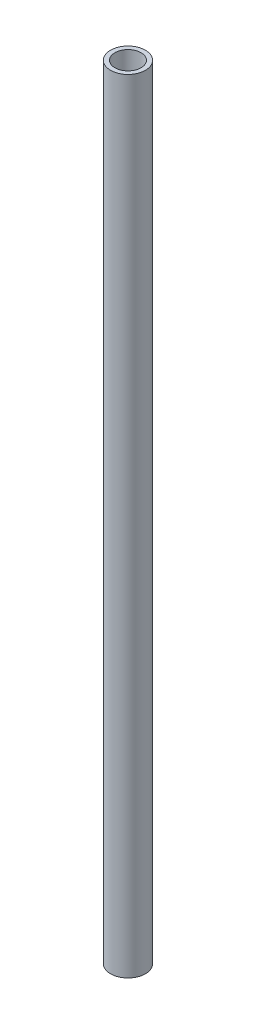
ISO-10303-21;
HEADER;
FILE_DESCRIPTION(('STEP AP214'),'2;1');
FILE_NAME('part.step','',(''),(''),'','','');
FILE_SCHEMA(('AUTOMOTIVE_DESIGN { 1 0 10303 214 1 1 1 1 }'));
ENDSEC;
DATA;
#1=APPLICATION_CONTEXT('core data for automotive mechanical design processes');
#2=APPLICATION_PROTOCOL_DEFINITION('international standard','automotive_design',2000,#1);
#3=PRODUCT_CONTEXT('',#1,'mechanical');
#4=PRODUCT('Part','Part','',(#3));
#5=PRODUCT_RELATED_PRODUCT_CATEGORY('part','',(#4));
#6=PRODUCT_DEFINITION_FORMATION('','',#4);
#7=PRODUCT_DEFINITION_CONTEXT('part definition',#1,'design');
#8=PRODUCT_DEFINITION('design','',#6,#7);
#9=PRODUCT_DEFINITION_SHAPE('','',#8);
#10=(LENGTH_UNIT() NAMED_UNIT(*) SI_UNIT(.MILLI.,.METRE.));
#11=(NAMED_UNIT(*) PLANE_ANGLE_UNIT() SI_UNIT($,.RADIAN.));
#12=(NAMED_UNIT(*) SI_UNIT($,.STERADIAN.) SOLID_ANGLE_UNIT());
#13=UNCERTAINTY_MEASURE_WITH_UNIT(LENGTH_MEASURE(1.E-05),#10,'distance_accuracy_value','');
#14=(GEOMETRIC_REPRESENTATION_CONTEXT(3) GLOBAL_UNCERTAINTY_ASSIGNED_CONTEXT((#13)) GLOBAL_UNIT_ASSIGNED_CONTEXT((#10,
#11,#12)) REPRESENTATION_CONTEXT('',''));
#15=CARTESIAN_POINT('',(0.,0.,0.));
#16=DIRECTION('',(0.,0.,1.));
#17=DIRECTION('',(1.,0.,0.));
#18=AXIS2_PLACEMENT_3D('',#15,#16,#17);
#19=CARTESIAN_POINT('',(0.,285.,0.));
#20=DIRECTION('',(0.,-1.,0.));
#21=DIRECTION('',(0.,0.,-1.));
#22=AXIS2_PLACEMENT_3D('',#19,#20,#21);
#23=CYLINDRICAL_SURFACE('',#22,6.35);
#24=CARTESIAN_POINT('',(0.,285.,0.));
#25=DIRECTION('',(0.,1.,0.));
#26=DIRECTION('',(0.,0.,1.));
#27=AXIS2_PLACEMENT_3D('',#24,#25,#26);
#28=CIRCLE('',#27,6.35);
#29=CARTESIAN_POINT('',(0.,285.,6.35));
#30=VERTEX_POINT('',#29);
#31=EDGE_CURVE('E10',#30,#30,#28,.T.);
#32=ORIENTED_EDGE('',*,*,#31,.F.);
#33=EDGE_LOOP('',(#32));
#34=FACE_BOUND('',#33,.T.);
#35=CARTESIAN_POINT('',(0.,0.,0.));
#36=DIRECTION('',(0.,1.,0.));
#37=DIRECTION('',(0.,0.,1.));
#38=AXIS2_PLACEMENT_3D('',#35,#36,#37);
#39=CIRCLE('',#38,6.35);
#40=CARTESIAN_POINT('',(0.,0.,6.35));
#41=VERTEX_POINT('',#40);
#42=EDGE_CURVE('E35',#41,#41,#39,.T.);
#43=ORIENTED_EDGE('',*,*,#42,.T.);
#44=EDGE_LOOP('',(#43));
#45=FACE_BOUND('',#44,.T.);
#46=ADVANCED_FACE('F32',(#34,#45),#23,.T.);
#47=CARTESIAN_POINT('',(0.,285.,0.));
#48=DIRECTION('',(0.,1.,0.));
#49=DIRECTION('',(0.,0.,1.));
#50=AXIS2_PLACEMENT_3D('',#47,#48,#49);
#51=PLANE('',#50);
#52=CARTESIAN_POINT('',(0.,285.,0.));
#53=DIRECTION('',(0.,1.,0.));
#54=DIRECTION('',(0.,0.,1.));
#55=AXIS2_PLACEMENT_3D('',#52,#53,#54);
#56=CIRCLE('',#55,4.765);
#57=CARTESIAN_POINT('',(0.,285.,4.765));
#58=VERTEX_POINT('',#57);
#59=EDGE_CURVE('E44',#58,#58,#56,.F.);
#60=ORIENTED_EDGE('',*,*,#59,.T.);
#61=EDGE_LOOP('',(#60));
#62=FACE_BOUND('',#61,.T.);
#63=ORIENTED_EDGE('',*,*,#31,.T.);
#64=EDGE_LOOP('',(#63));
#65=FACE_BOUND('',#64,.T.);
#66=ADVANCED_FACE('F55',(#62,#65),#51,.T.);
#67=CARTESIAN_POINT('',(0.,0.,0.));
#68=DIRECTION('',(0.,1.,0.));
#69=DIRECTION('',(0.,0.,1.));
#70=AXIS2_PLACEMENT_3D('',#67,#68,#69);
#71=PLANE('',#70);
#72=CARTESIAN_POINT('',(0.,0.,0.));
#73=DIRECTION('',(0.,-1.,0.));
#74=DIRECTION('',(0.,0.,-1.));
#75=AXIS2_PLACEMENT_3D('',#72,#73,#74);
#76=CIRCLE('',#75,4.765);
#77=CARTESIAN_POINT('',(0.,0.,-4.765));
#78=VERTEX_POINT('',#77);
#79=EDGE_CURVE('E42',#78,#78,#76,.T.);
#80=ORIENTED_EDGE('',*,*,#79,.F.);
#81=EDGE_LOOP('',(#80));
#82=FACE_BOUND('',#81,.T.);
#83=ORIENTED_EDGE('',*,*,#42,.F.);
#84=EDGE_LOOP('',(#83));
#85=FACE_BOUND('',#84,.T.);
#86=ADVANCED_FACE('F52',(#82,#85),#71,.F.);
#87=CARTESIAN_POINT('',(0.,285.001,0.));
#88=DIRECTION('',(0.,-1.,0.));
#89=DIRECTION('',(0.,0.,-1.));
#90=AXIS2_PLACEMENT_3D('',#87,#88,#89);
#91=CYLINDRICAL_SURFACE('',#90,4.765);
#92=ORIENTED_EDGE('',*,*,#59,.F.);
#93=EDGE_LOOP('',(#92));
#94=FACE_BOUND('',#93,.T.);
#95=ORIENTED_EDGE('',*,*,#79,.T.);
#96=EDGE_LOOP('',(#95));
#97=FACE_BOUND('',#96,.T.);
#98=ADVANCED_FACE('F50',(#94,#97),#91,.F.);
#99=CLOSED_SHELL('',(#46,#66,#86,#98));
#100=MANIFOLD_SOLID_BREP('B2',#99);
#101=ADVANCED_BREP_SHAPE_REPRESENTATION('',(#18,#100),#14);
#102=SHAPE_DEFINITION_REPRESENTATION(#9,#101);
ENDSEC;
END-ISO-10303-21;
